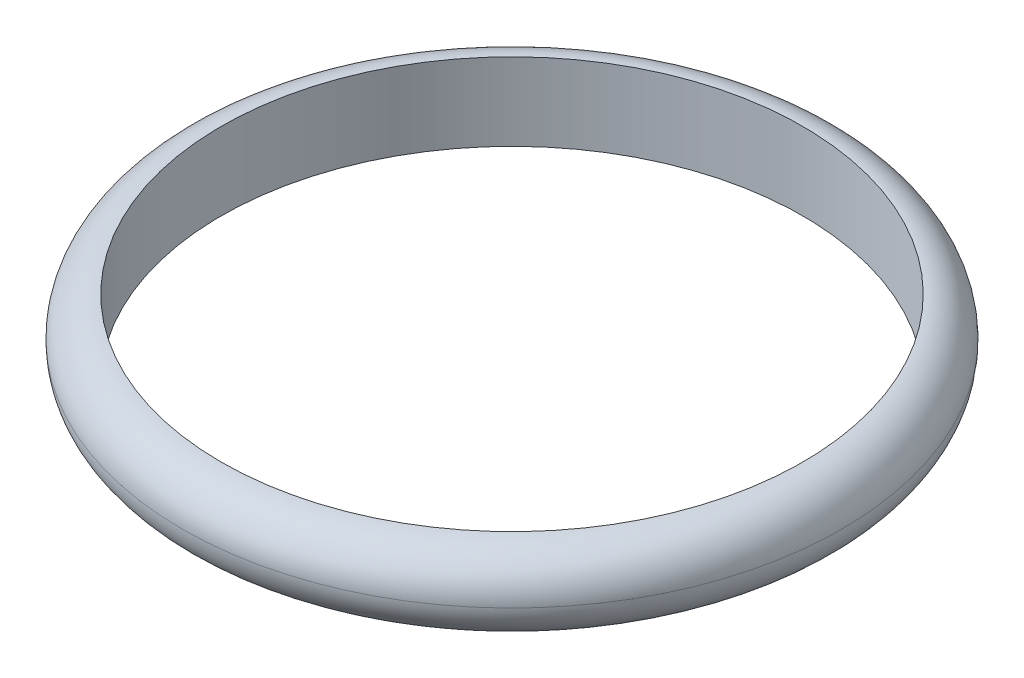
ISO-10303-21;
HEADER;
FILE_DESCRIPTION(('STEP AP214'),'2;1');
FILE_NAME('part.step','',(''),(''),'','','');
FILE_SCHEMA(('AUTOMOTIVE_DESIGN { 1 0 10303 214 1 1 1 1 }'));
ENDSEC;
DATA;
#1=APPLICATION_CONTEXT('core data for automotive mechanical design processes');
#2=APPLICATION_PROTOCOL_DEFINITION('international standard','automotive_design',2000,#1);
#3=PRODUCT_CONTEXT('',#1,'mechanical');
#4=PRODUCT('Part','Part','',(#3));
#5=PRODUCT_RELATED_PRODUCT_CATEGORY('part','',(#4));
#6=PRODUCT_DEFINITION_FORMATION('','',#4);
#7=PRODUCT_DEFINITION_CONTEXT('part definition',#1,'design');
#8=PRODUCT_DEFINITION('design','',#6,#7);
#9=PRODUCT_DEFINITION_SHAPE('','',#8);
#10=(LENGTH_UNIT() NAMED_UNIT(*) SI_UNIT(.MILLI.,.METRE.));
#11=(NAMED_UNIT(*) PLANE_ANGLE_UNIT() SI_UNIT($,.RADIAN.));
#12=(NAMED_UNIT(*) SI_UNIT($,.STERADIAN.) SOLID_ANGLE_UNIT());
#13=UNCERTAINTY_MEASURE_WITH_UNIT(LENGTH_MEASURE(1.E-05),#10,'distance_accuracy_value','');
#14=(GEOMETRIC_REPRESENTATION_CONTEXT(3) GLOBAL_UNCERTAINTY_ASSIGNED_CONTEXT((#13)) GLOBAL_UNIT_ASSIGNED_CONTEXT((#10,
#11,#12)) REPRESENTATION_CONTEXT('',''));
#15=CARTESIAN_POINT('',(0.,0.,0.));
#16=DIRECTION('',(0.,0.,1.));
#17=DIRECTION('',(1.,0.,0.));
#18=AXIS2_PLACEMENT_3D('',#15,#16,#17);
#19=CARTESIAN_POINT('',(0.,4.,0.));
#20=DIRECTION('',(0.,-1.,0.));
#21=DIRECTION('',(0.,0.,-1.));
#22=AXIS2_PLACEMENT_3D('',#19,#20,#21);
#23=CYLINDRICAL_SURFACE('',#22,15.);
#24=CARTESIAN_POINT('',(0.,4.,0.));
#25=DIRECTION('',(0.,1.,0.));
#26=DIRECTION('',(0.,0.,1.));
#27=AXIS2_PLACEMENT_3D('',#24,#25,#26);
#28=CIRCLE('',#27,15.);
#29=CARTESIAN_POINT('',(0.,4.,15.));
#30=VERTEX_POINT('',#29);
#31=EDGE_CURVE('E10',#30,#30,#28,.T.);
#32=ORIENTED_EDGE('',*,*,#31,.T.);
#33=EDGE_LOOP('',(#32));
#34=FACE_BOUND('',#33,.T.);
#35=CARTESIAN_POINT('',(0.,0.,0.));
#36=DIRECTION('',(0.,1.,0.));
#37=DIRECTION('',(0.,0.,1.));
#38=AXIS2_PLACEMENT_3D('',#35,#36,#37);
#39=CIRCLE('',#38,15.);
#40=CARTESIAN_POINT('',(0.,0.,15.));
#41=VERTEX_POINT('',#40);
#42=EDGE_CURVE('E37',#41,#41,#39,.T.);
#43=ORIENTED_EDGE('',*,*,#42,.F.);
#44=EDGE_LOOP('',(#43));
#45=FACE_BOUND('',#44,.T.);
#46=ADVANCED_FACE('F29',(#34,#45),#23,.F.);
#47=CARTESIAN_POINT('',(0.,2.,0.));
#48=DIRECTION('',(0.,1.,0.));
#49=DIRECTION('',(0.,0.,1.));
#50=AXIS2_PLACEMENT_3D('',#47,#48,#49);
#51=TOROIDAL_SURFACE('',#50,15.,2.);
#52=ORIENTED_EDGE('',*,*,#31,.F.);
#53=EDGE_LOOP('',(#52));
#54=FACE_BOUND('',#53,.T.);
#55=CARTESIAN_POINT('',(0.,2.,0.));
#56=DIRECTION('',(0.,1.,0.));
#57=DIRECTION('',(0.,0.,1.));
#58=AXIS2_PLACEMENT_3D('',#55,#56,#57);
#59=CIRCLE('',#58,17.);
#60=CARTESIAN_POINT('',(0.,2.,17.));
#61=VERTEX_POINT('',#60);
#62=EDGE_CURVE('E33',#61,#61,#59,.F.);
#63=ORIENTED_EDGE('',*,*,#62,.F.);
#64=EDGE_LOOP('',(#63));
#65=FACE_BOUND('',#64,.T.);
#66=ADVANCED_FACE('F31',(#54,#65),#51,.T.);
#67=CARTESIAN_POINT('',(0.,2.,0.));
#68=DIRECTION('',(0.,1.,0.));
#69=DIRECTION('',(0.,0.,1.));
#70=AXIS2_PLACEMENT_3D('',#67,#68,#69);
#71=TOROIDAL_SURFACE('',#70,15.,2.);
#72=ORIENTED_EDGE('',*,*,#42,.T.);
#73=EDGE_LOOP('',(#72));
#74=FACE_BOUND('',#73,.T.);
#75=ORIENTED_EDGE('',*,*,#62,.T.);
#76=EDGE_LOOP('',(#75));
#77=FACE_BOUND('',#76,.T.);
#78=ADVANCED_FACE('F47',(#74,#77),#71,.T.);
#79=CLOSED_SHELL('',(#46,#66,#78));
#80=MANIFOLD_SOLID_BREP('B2',#79);
#81=ADVANCED_BREP_SHAPE_REPRESENTATION('',(#18,#80),#14);
#82=SHAPE_DEFINITION_REPRESENTATION(#9,#81);
ENDSEC;
END-ISO-10303-21;
